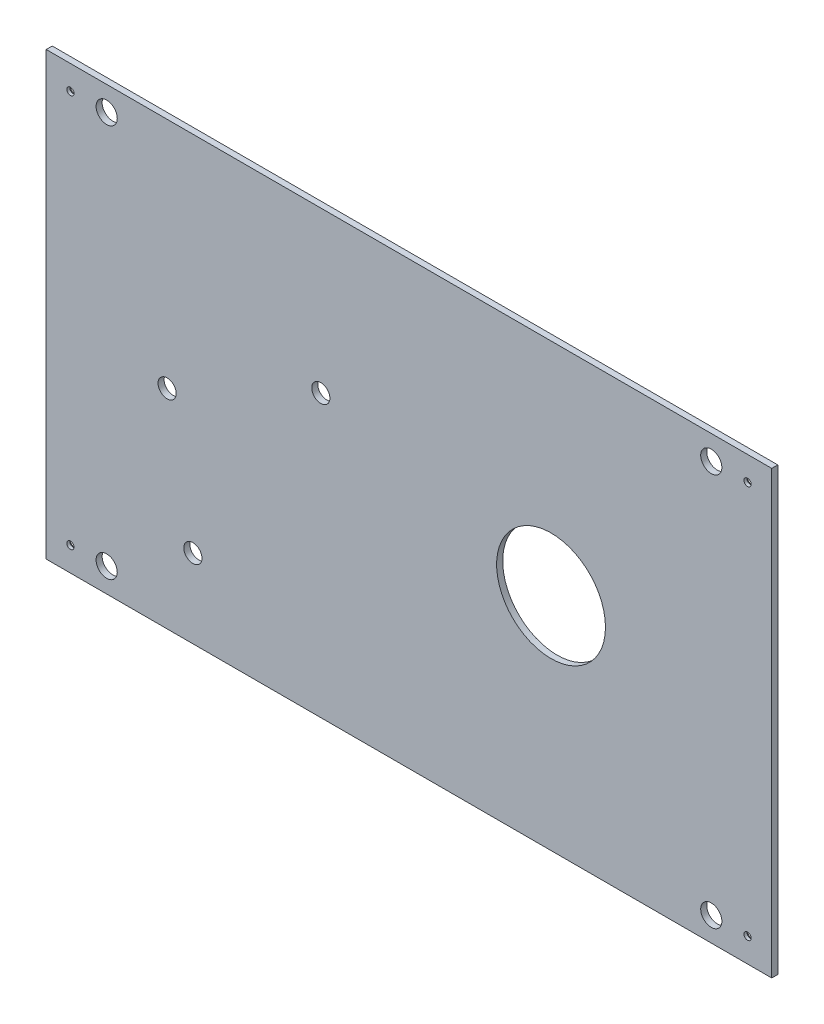
ISO-10303-21;
HEADER;
FILE_DESCRIPTION(('STEP AP214'),'2;1');
FILE_NAME('part.step','',(''),(''),'','','');
FILE_SCHEMA(('AUTOMOTIVE_DESIGN { 1 0 10303 214 1 1 1 1 }'));
ENDSEC;
DATA;
#1=APPLICATION_CONTEXT('core data for automotive mechanical design processes');
#2=APPLICATION_PROTOCOL_DEFINITION('international standard','automotive_design',2000,#1);
#3=PRODUCT_CONTEXT('',#1,'mechanical');
#4=PRODUCT('Part','Part','',(#3));
#5=PRODUCT_RELATED_PRODUCT_CATEGORY('part','',(#4));
#6=PRODUCT_DEFINITION_FORMATION('','',#4);
#7=PRODUCT_DEFINITION_CONTEXT('part definition',#1,'design');
#8=PRODUCT_DEFINITION('design','',#6,#7);
#9=PRODUCT_DEFINITION_SHAPE('','',#8);
#10=(LENGTH_UNIT() NAMED_UNIT(*) SI_UNIT(.MILLI.,.METRE.));
#11=(NAMED_UNIT(*) PLANE_ANGLE_UNIT() SI_UNIT($,.RADIAN.));
#12=(NAMED_UNIT(*) SI_UNIT($,.STERADIAN.) SOLID_ANGLE_UNIT());
#13=UNCERTAINTY_MEASURE_WITH_UNIT(LENGTH_MEASURE(1.E-05),#10,'distance_accuracy_value','');
#14=(GEOMETRIC_REPRESENTATION_CONTEXT(3) GLOBAL_UNCERTAINTY_ASSIGNED_CONTEXT((#13)) GLOBAL_UNIT_ASSIGNED_CONTEXT((#10,
#11,#12)) REPRESENTATION_CONTEXT('',''));
#15=CARTESIAN_POINT('',(0.,0.,0.));
#16=DIRECTION('',(0.,0.,1.));
#17=DIRECTION('',(1.,0.,0.));
#18=AXIS2_PLACEMENT_3D('',#15,#16,#17);
#19=CARTESIAN_POINT('',(0.,0.,2.));
#20=DIRECTION('',(0.,1.,0.));
#21=DIRECTION('',(0.,0.,1.));
#22=AXIS2_PLACEMENT_3D('',#19,#20,#21);
#23=PLANE('',#22);
#24=DIRECTION('',(1.,0.,0.));
#25=VECTOR('',#24,1.);
#26=CARTESIAN_POINT('',(0.,0.,0.));
#27=LINE('',#26,#25);
#28=CARTESIAN_POINT('',(0.,0.,0.));
#29=VERTEX_POINT('',#28);
#30=CARTESIAN_POINT('',(240.,0.,0.));
#31=VERTEX_POINT('',#30);
#32=EDGE_CURVE('E146',#29,#31,#27,.T.);
#33=ORIENTED_EDGE('',*,*,#32,.T.);
#34=DIRECTION('',(0.,0.,-1.));
#35=VECTOR('',#34,1.);
#36=CARTESIAN_POINT('',(240.,0.,2.));
#37=LINE('',#36,#35);
#38=CARTESIAN_POINT('',(240.,0.,2.));
#39=VERTEX_POINT('',#38);
#40=EDGE_CURVE('E11',#39,#31,#37,.T.);
#41=ORIENTED_EDGE('',*,*,#40,.F.);
#42=DIRECTION('',(1.,0.,0.));
#43=VECTOR('',#42,1.);
#44=CARTESIAN_POINT('',(0.,0.,2.));
#45=LINE('',#44,#43);
#46=CARTESIAN_POINT('',(0.,0.,2.));
#47=VERTEX_POINT('',#46);
#48=EDGE_CURVE('E95',#47,#39,#45,.T.);
#49=ORIENTED_EDGE('',*,*,#48,.F.);
#50=DIRECTION('',(0.,0.,-1.));
#51=VECTOR('',#50,1.);
#52=CARTESIAN_POINT('',(0.,0.,2.));
#53=LINE('',#52,#51);
#54=EDGE_CURVE('E61',#47,#29,#53,.T.);
#55=ORIENTED_EDGE('',*,*,#54,.T.);
#56=EDGE_LOOP('',(#33,#41,#49,#55));
#57=FACE_BOUND('',#56,.T.);
#58=ADVANCED_FACE('F43',(#57),#23,.F.);
#59=CARTESIAN_POINT('',(240.,0.,2.));
#60=DIRECTION('',(-1.,0.,0.));
#61=DIRECTION('',(0.,0.,1.));
#62=AXIS2_PLACEMENT_3D('',#59,#60,#61);
#63=PLANE('',#62);
#64=DIRECTION('',(0.,1.,0.));
#65=VECTOR('',#64,1.);
#66=CARTESIAN_POINT('',(240.,0.,0.));
#67=LINE('',#66,#65);
#68=CARTESIAN_POINT('',(240.,146.,0.));
#69=VERTEX_POINT('',#68);
#70=EDGE_CURVE('E101',#31,#69,#67,.T.);
#71=ORIENTED_EDGE('',*,*,#70,.T.);
#72=DIRECTION('',(0.,0.,-1.));
#73=VECTOR('',#72,1.);
#74=CARTESIAN_POINT('',(240.,146.,2.));
#75=LINE('',#74,#73);
#76=CARTESIAN_POINT('',(240.,146.,2.));
#77=VERTEX_POINT('',#76);
#78=EDGE_CURVE('E53',#77,#69,#75,.T.);
#79=ORIENTED_EDGE('',*,*,#78,.F.);
#80=DIRECTION('',(0.,1.,0.));
#81=VECTOR('',#80,1.);
#82=CARTESIAN_POINT('',(240.,0.,2.));
#83=LINE('',#82,#81);
#84=EDGE_CURVE('E86',#39,#77,#83,.T.);
#85=ORIENTED_EDGE('',*,*,#84,.F.);
#86=ORIENTED_EDGE('',*,*,#40,.T.);
#87=EDGE_LOOP('',(#71,#79,#85,#86));
#88=FACE_BOUND('',#87,.T.);
#89=ADVANCED_FACE('F100',(#88),#63,.F.);
#90=CARTESIAN_POINT('',(0.,146.,2.));
#91=DIRECTION('',(0.,1.,0.));
#92=DIRECTION('',(0.,0.,1.));
#93=AXIS2_PLACEMENT_3D('',#90,#91,#92);
#94=PLANE('',#93);
#95=DIRECTION('',(1.,0.,0.));
#96=VECTOR('',#95,1.);
#97=CARTESIAN_POINT('',(0.,146.,0.));
#98=LINE('',#97,#96);
#99=CARTESIAN_POINT('',(0.,146.,0.));
#100=VERTEX_POINT('',#99);
#101=EDGE_CURVE('E151',#100,#69,#98,.T.);
#102=ORIENTED_EDGE('',*,*,#101,.F.);
#103=DIRECTION('',(0.,0.,-1.));
#104=VECTOR('',#103,1.);
#105=CARTESIAN_POINT('',(0.,146.,2.));
#106=LINE('',#105,#104);
#107=CARTESIAN_POINT('',(0.,146.,2.));
#108=VERTEX_POINT('',#107);
#109=EDGE_CURVE('E75',#108,#100,#106,.T.);
#110=ORIENTED_EDGE('',*,*,#109,.F.);
#111=DIRECTION('',(1.,0.,0.));
#112=VECTOR('',#111,1.);
#113=CARTESIAN_POINT('',(0.,146.,2.));
#114=LINE('',#113,#112);
#115=EDGE_CURVE('E94',#108,#77,#114,.T.);
#116=ORIENTED_EDGE('',*,*,#115,.T.);
#117=ORIENTED_EDGE('',*,*,#78,.T.);
#118=EDGE_LOOP('',(#102,#110,#116,#117));
#119=FACE_BOUND('',#118,.T.);
#120=ADVANCED_FACE('F105',(#119),#94,.T.);
#121=CARTESIAN_POINT('',(220.,8.00000000000001,2.));
#122=DIRECTION('',(0.,0.,-1.));
#123=DIRECTION('',(-1.,0.,0.));
#124=AXIS2_PLACEMENT_3D('',#121,#122,#123);
#125=CYLINDRICAL_SURFACE('',#124,3.49999999999999);
#126=CARTESIAN_POINT('',(220.,8.00000000000001,2.));
#127=DIRECTION('',(0.,0.,1.));
#128=DIRECTION('',(1.,0.,0.));
#129=AXIS2_PLACEMENT_3D('',#126,#127,#128);
#130=CIRCLE('',#129,3.49999999999999);
#131=CARTESIAN_POINT('',(223.5,8.00000000000001,2.));
#132=VERTEX_POINT('',#131);
#133=EDGE_CURVE('E110',#132,#132,#130,.T.);
#134=ORIENTED_EDGE('',*,*,#133,.T.);
#135=EDGE_LOOP('',(#134));
#136=FACE_BOUND('',#135,.T.);
#137=CARTESIAN_POINT('',(220.,8.00000000000001,0.));
#138=DIRECTION('',(0.,0.,1.));
#139=DIRECTION('',(1.,0.,0.));
#140=AXIS2_PLACEMENT_3D('',#137,#138,#139);
#141=CIRCLE('',#140,3.49999999999999);
#142=CARTESIAN_POINT('',(223.5,8.00000000000001,0.));
#143=VERTEX_POINT('',#142);
#144=EDGE_CURVE('E158',#143,#143,#141,.T.);
#145=ORIENTED_EDGE('',*,*,#144,.F.);
#146=EDGE_LOOP('',(#145));
#147=FACE_BOUND('',#146,.T.);
#148=ADVANCED_FACE('F268',(#136,#147),#125,.F.);
#149=CARTESIAN_POINT('',(0.,0.,2.));
#150=DIRECTION('',(-1.,0.,0.));
#151=DIRECTION('',(0.,0.,1.));
#152=AXIS2_PLACEMENT_3D('',#149,#150,#151);
#153=PLANE('',#152);
#154=DIRECTION('',(0.,1.,0.));
#155=VECTOR('',#154,1.);
#156=CARTESIAN_POINT('',(0.,0.,0.));
#157=LINE('',#156,#155);
#158=EDGE_CURVE('E154',#29,#100,#157,.T.);
#159=ORIENTED_EDGE('',*,*,#158,.F.);
#160=ORIENTED_EDGE('',*,*,#54,.F.);
#161=DIRECTION('',(0.,1.,0.));
#162=VECTOR('',#161,1.);
#163=CARTESIAN_POINT('',(0.,0.,2.));
#164=LINE('',#163,#162);
#165=EDGE_CURVE('E107',#47,#108,#164,.T.);
#166=ORIENTED_EDGE('',*,*,#165,.T.);
#167=ORIENTED_EDGE('',*,*,#109,.T.);
#168=EDGE_LOOP('',(#159,#160,#166,#167));
#169=FACE_BOUND('',#168,.T.);
#170=ADVANCED_FACE('F233',(#169),#153,.T.);
#171=CARTESIAN_POINT('',(48.5153507489251,26.,2.));
#172=DIRECTION('',(0.,0.,-1.));
#173=DIRECTION('',(-1.,0.,0.));
#174=AXIS2_PLACEMENT_3D('',#171,#172,#173);
#175=CYLINDRICAL_SURFACE('',#174,3.);
#176=CARTESIAN_POINT('',(48.5153507489251,26.,2.));
#177=DIRECTION('',(0.,0.,1.));
#178=DIRECTION('',(1.,0.,0.));
#179=AXIS2_PLACEMENT_3D('',#176,#177,#178);
#180=CIRCLE('',#179,3.);
#181=CARTESIAN_POINT('',(51.5153507489251,26.,2.));
#182=VERTEX_POINT('',#181);
#183=EDGE_CURVE('E196',#182,#182,#180,.T.);
#184=ORIENTED_EDGE('',*,*,#183,.T.);
#185=EDGE_LOOP('',(#184));
#186=FACE_BOUND('',#185,.T.);
#187=CARTESIAN_POINT('',(48.5153507489251,26.,0.));
#188=DIRECTION('',(0.,0.,1.));
#189=DIRECTION('',(1.,0.,0.));
#190=AXIS2_PLACEMENT_3D('',#187,#188,#189);
#191=CIRCLE('',#190,3.);
#192=CARTESIAN_POINT('',(51.5153507489251,26.,0.));
#193=VERTEX_POINT('',#192);
#194=EDGE_CURVE('E142',#193,#193,#191,.T.);
#195=ORIENTED_EDGE('',*,*,#194,.F.);
#196=EDGE_LOOP('',(#195));
#197=FACE_BOUND('',#196,.T.);
#198=ADVANCED_FACE('F202',(#186,#197),#175,.F.);
#199=CARTESIAN_POINT('',(40.,68.9132998221155,2.));
#200=DIRECTION('',(0.,0.,-1.));
#201=DIRECTION('',(-1.,0.,0.));
#202=AXIS2_PLACEMENT_3D('',#199,#200,#201);
#203=CYLINDRICAL_SURFACE('',#202,3.);
#204=CARTESIAN_POINT('',(40.,68.9132998221155,2.));
#205=DIRECTION('',(0.,0.,1.));
#206=DIRECTION('',(1.,0.,0.));
#207=AXIS2_PLACEMENT_3D('',#204,#205,#206);
#208=CIRCLE('',#207,3.);
#209=CARTESIAN_POINT('',(43.,68.9132998221155,2.));
#210=VERTEX_POINT('',#209);
#211=EDGE_CURVE('E192',#210,#210,#208,.T.);
#212=ORIENTED_EDGE('',*,*,#211,.T.);
#213=EDGE_LOOP('',(#212));
#214=FACE_BOUND('',#213,.T.);
#215=CARTESIAN_POINT('',(40.,68.9132998221155,0.));
#216=DIRECTION('',(0.,0.,1.));
#217=DIRECTION('',(1.,0.,0.));
#218=AXIS2_PLACEMENT_3D('',#215,#216,#217);
#219=CIRCLE('',#218,3.);
#220=CARTESIAN_POINT('',(43.,68.9132998221155,0.));
#221=VERTEX_POINT('',#220);
#222=EDGE_CURVE('E138',#221,#221,#219,.T.);
#223=ORIENTED_EDGE('',*,*,#222,.F.);
#224=EDGE_LOOP('',(#223));
#225=FACE_BOUND('',#224,.T.);
#226=ADVANCED_FACE('F232',(#214,#225),#203,.F.);
#227=CARTESIAN_POINT('',(90.8320113170894,93.,2.));
#228=DIRECTION('',(0.,0.,-1.));
#229=DIRECTION('',(-1.,0.,0.));
#230=AXIS2_PLACEMENT_3D('',#227,#228,#229);
#231=CYLINDRICAL_SURFACE('',#230,3.00000000000001);
#232=CARTESIAN_POINT('',(90.8320113170894,93.,2.));
#233=DIRECTION('',(0.,0.,1.));
#234=DIRECTION('',(1.,0.,0.));
#235=AXIS2_PLACEMENT_3D('',#232,#233,#234);
#236=CIRCLE('',#235,3.00000000000001);
#237=CARTESIAN_POINT('',(93.8320113170894,93.,2.));
#238=VERTEX_POINT('',#237);
#239=EDGE_CURVE('E188',#238,#238,#236,.T.);
#240=ORIENTED_EDGE('',*,*,#239,.T.);
#241=EDGE_LOOP('',(#240));
#242=FACE_BOUND('',#241,.T.);
#243=CARTESIAN_POINT('',(90.8320113170894,93.,0.));
#244=DIRECTION('',(0.,0.,1.));
#245=DIRECTION('',(1.,0.,0.));
#246=AXIS2_PLACEMENT_3D('',#243,#244,#245);
#247=CIRCLE('',#246,3.00000000000001);
#248=CARTESIAN_POINT('',(93.8320113170894,93.,0.));
#249=VERTEX_POINT('',#248);
#250=EDGE_CURVE('E134',#249,#249,#247,.T.);
#251=ORIENTED_EDGE('',*,*,#250,.F.);
#252=EDGE_LOOP('',(#251));
#253=FACE_BOUND('',#252,.T.);
#254=ADVANCED_FACE('F236',(#242,#253),#231,.F.);
#255=CARTESIAN_POINT('',(167.,73.,2.));
#256=DIRECTION('',(0.,0.,-1.));
#257=DIRECTION('',(-1.,0.,0.));
#258=AXIS2_PLACEMENT_3D('',#255,#256,#257);
#259=CYLINDRICAL_SURFACE('',#258,18.);
#260=CARTESIAN_POINT('',(167.,73.,2.));
#261=DIRECTION('',(0.,0.,1.));
#262=DIRECTION('',(1.,0.,0.));
#263=AXIS2_PLACEMENT_3D('',#260,#261,#262);
#264=CIRCLE('',#263,18.);
#265=CARTESIAN_POINT('',(185.,73.,2.));
#266=VERTEX_POINT('',#265);
#267=EDGE_CURVE('E180',#266,#266,#264,.T.);
#268=ORIENTED_EDGE('',*,*,#267,.T.);
#269=EDGE_LOOP('',(#268));
#270=FACE_BOUND('',#269,.T.);
#271=CARTESIAN_POINT('',(167.,73.,0.));
#272=DIRECTION('',(0.,0.,1.));
#273=DIRECTION('',(1.,0.,0.));
#274=AXIS2_PLACEMENT_3D('',#271,#272,#273);
#275=CIRCLE('',#274,18.);
#276=CARTESIAN_POINT('',(185.,73.,0.));
#277=VERTEX_POINT('',#276);
#278=EDGE_CURVE('E130',#277,#277,#275,.T.);
#279=ORIENTED_EDGE('',*,*,#278,.F.);
#280=EDGE_LOOP('',(#279));
#281=FACE_BOUND('',#280,.T.);
#282=ADVANCED_FACE('F240',(#270,#281),#259,.F.);
#283=CARTESIAN_POINT('',(20.,138.,2.));
#284=DIRECTION('',(0.,0.,-1.));
#285=DIRECTION('',(-1.,0.,0.));
#286=AXIS2_PLACEMENT_3D('',#283,#284,#285);
#287=CYLINDRICAL_SURFACE('',#286,3.5);
#288=CARTESIAN_POINT('',(20.,138.,2.));
#289=DIRECTION('',(0.,0.,1.));
#290=DIRECTION('',(1.,0.,0.));
#291=AXIS2_PLACEMENT_3D('',#288,#289,#290);
#292=CIRCLE('',#291,3.5);
#293=CARTESIAN_POINT('',(23.5,138.,2.));
#294=VERTEX_POINT('',#293);
#295=EDGE_CURVE('E174',#294,#294,#292,.T.);
#296=ORIENTED_EDGE('',*,*,#295,.T.);
#297=EDGE_LOOP('',(#296));
#298=FACE_BOUND('',#297,.T.);
#299=CARTESIAN_POINT('',(20.,138.,0.));
#300=DIRECTION('',(0.,0.,1.));
#301=DIRECTION('',(1.,0.,0.));
#302=AXIS2_PLACEMENT_3D('',#299,#300,#301);
#303=CIRCLE('',#302,3.5);
#304=CARTESIAN_POINT('',(23.5,138.,0.));
#305=VERTEX_POINT('',#304);
#306=EDGE_CURVE('E125',#305,#305,#303,.T.);
#307=ORIENTED_EDGE('',*,*,#306,.F.);
#308=EDGE_LOOP('',(#307));
#309=FACE_BOUND('',#308,.T.);
#310=ADVANCED_FACE('F243',(#298,#309),#287,.F.);
#311=CARTESIAN_POINT('',(20.,8.00000000000001,2.));
#312=DIRECTION('',(0.,0.,-1.));
#313=DIRECTION('',(-1.,0.,0.));
#314=AXIS2_PLACEMENT_3D('',#311,#312,#313);
#315=CYLINDRICAL_SURFACE('',#314,3.5);
#316=CARTESIAN_POINT('',(20.,8.00000000000001,2.));
#317=DIRECTION('',(0.,0.,1.));
#318=DIRECTION('',(1.,0.,0.));
#319=AXIS2_PLACEMENT_3D('',#316,#317,#318);
#320=CIRCLE('',#319,3.5);
#321=CARTESIAN_POINT('',(23.5,8.00000000000001,2.));
#322=VERTEX_POINT('',#321);
#323=EDGE_CURVE('E166',#322,#322,#320,.F.);
#324=ORIENTED_EDGE('',*,*,#323,.F.);
#325=EDGE_LOOP('',(#324));
#326=FACE_BOUND('',#325,.T.);
#327=CARTESIAN_POINT('',(20.,8.00000000000001,0.));
#328=DIRECTION('',(0.,0.,1.));
#329=DIRECTION('',(1.,0.,0.));
#330=AXIS2_PLACEMENT_3D('',#327,#328,#329);
#331=CIRCLE('',#330,3.5);
#332=CARTESIAN_POINT('',(23.5,8.00000000000001,0.));
#333=VERTEX_POINT('',#332);
#334=EDGE_CURVE('E121',#333,#333,#331,.F.);
#335=ORIENTED_EDGE('',*,*,#334,.T.);
#336=EDGE_LOOP('',(#335));
#337=FACE_BOUND('',#336,.T.);
#338=ADVANCED_FACE('F45',(#326,#337),#315,.F.);
#339=CARTESIAN_POINT('',(220.,138.,2.));
#340=DIRECTION('',(0.,0.,-1.));
#341=DIRECTION('',(-1.,0.,0.));
#342=AXIS2_PLACEMENT_3D('',#339,#340,#341);
#343=CYLINDRICAL_SURFACE('',#342,3.49999999999999);
#344=CARTESIAN_POINT('',(220.,138.,2.));
#345=DIRECTION('',(0.,0.,1.));
#346=DIRECTION('',(1.,0.,0.));
#347=AXIS2_PLACEMENT_3D('',#344,#345,#346);
#348=CIRCLE('',#347,3.49999999999999);
#349=CARTESIAN_POINT('',(223.5,138.,2.));
#350=VERTEX_POINT('',#349);
#351=EDGE_CURVE('E117',#350,#350,#348,.F.);
#352=ORIENTED_EDGE('',*,*,#351,.F.);
#353=EDGE_LOOP('',(#352));
#354=FACE_BOUND('',#353,.T.);
#355=CARTESIAN_POINT('',(220.,138.,0.));
#356=DIRECTION('',(0.,0.,1.));
#357=DIRECTION('',(1.,0.,0.));
#358=AXIS2_PLACEMENT_3D('',#355,#356,#357);
#359=CIRCLE('',#358,3.49999999999999);
#360=CARTESIAN_POINT('',(223.5,138.,0.));
#361=VERTEX_POINT('',#360);
#362=EDGE_CURVE('E162',#361,#361,#359,.F.);
#363=ORIENTED_EDGE('',*,*,#362,.T.);
#364=EDGE_LOOP('',(#363));
#365=FACE_BOUND('',#364,.T.);
#366=ADVANCED_FACE('F207',(#354,#365),#343,.F.);
#367=CARTESIAN_POINT('',(0.,0.,2.));
#368=DIRECTION('',(0.,0.,1.));
#369=DIRECTION('',(1.,0.,0.));
#370=AXIS2_PLACEMENT_3D('',#367,#368,#369);
#371=PLANE('',#370);
#372=CARTESIAN_POINT('',(232.,138.,2.));
#373=DIRECTION('',(0.,0.,-1.));
#374=DIRECTION('',(-1.,0.,0.));
#375=AXIS2_PLACEMENT_3D('',#372,#373,#374);
#376=CIRCLE('',#375,1.20000000000001);
#377=CARTESIAN_POINT('',(230.8,138.,2.));
#378=VERTEX_POINT('',#377);
#379=EDGE_CURVE('E443',#378,#378,#376,.T.);
#380=ORIENTED_EDGE('',*,*,#379,.T.);
#381=EDGE_LOOP('',(#380));
#382=FACE_BOUND('',#381,.T.);
#383=CARTESIAN_POINT('',(8.,138.,2.));
#384=DIRECTION('',(0.,0.,-1.));
#385=DIRECTION('',(-1.,0.,0.));
#386=AXIS2_PLACEMENT_3D('',#383,#384,#385);
#387=CIRCLE('',#386,1.19999999999999);
#388=CARTESIAN_POINT('',(6.80000000000001,138.,2.));
#389=VERTEX_POINT('',#388);
#390=EDGE_CURVE('E456',#389,#389,#387,.T.);
#391=ORIENTED_EDGE('',*,*,#390,.T.);
#392=EDGE_LOOP('',(#391));
#393=FACE_BOUND('',#392,.T.);
#394=CARTESIAN_POINT('',(8.,8.00000000000001,2.));
#395=DIRECTION('',(0.,0.,-1.));
#396=DIRECTION('',(-1.,0.,0.));
#397=AXIS2_PLACEMENT_3D('',#394,#395,#396);
#398=CIRCLE('',#397,1.19999999999999);
#399=CARTESIAN_POINT('',(6.80000000000001,8.00000000000001,2.));
#400=VERTEX_POINT('',#399);
#401=EDGE_CURVE('E468',#400,#400,#398,.T.);
#402=ORIENTED_EDGE('',*,*,#401,.T.);
#403=EDGE_LOOP('',(#402));
#404=FACE_BOUND('',#403,.T.);
#405=CARTESIAN_POINT('',(232.,8.00000000000001,2.));
#406=DIRECTION('',(0.,0.,-1.));
#407=DIRECTION('',(-1.,0.,0.));
#408=AXIS2_PLACEMENT_3D('',#405,#406,#407);
#409=CIRCLE('',#408,1.20000000000001);
#410=CARTESIAN_POINT('',(230.8,8.00000000000001,2.));
#411=VERTEX_POINT('',#410);
#412=EDGE_CURVE('E126',#411,#411,#409,.T.);
#413=ORIENTED_EDGE('',*,*,#412,.T.);
#414=EDGE_LOOP('',(#413));
#415=FACE_BOUND('',#414,.T.);
#416=ORIENTED_EDGE('',*,*,#323,.T.);
#417=EDGE_LOOP('',(#416));
#418=FACE_BOUND('',#417,.T.);
#419=ORIENTED_EDGE('',*,*,#295,.F.);
#420=EDGE_LOOP('',(#419));
#421=FACE_BOUND('',#420,.T.);
#422=ORIENTED_EDGE('',*,*,#267,.F.);
#423=EDGE_LOOP('',(#422));
#424=FACE_BOUND('',#423,.T.);
#425=ORIENTED_EDGE('',*,*,#239,.F.);
#426=EDGE_LOOP('',(#425));
#427=FACE_BOUND('',#426,.T.);
#428=ORIENTED_EDGE('',*,*,#211,.F.);
#429=EDGE_LOOP('',(#428));
#430=FACE_BOUND('',#429,.T.);
#431=ORIENTED_EDGE('',*,*,#183,.F.);
#432=EDGE_LOOP('',(#431));
#433=FACE_BOUND('',#432,.T.);
#434=ORIENTED_EDGE('',*,*,#48,.T.);
#435=ORIENTED_EDGE('',*,*,#84,.T.);
#436=ORIENTED_EDGE('',*,*,#115,.F.);
#437=ORIENTED_EDGE('',*,*,#165,.F.);
#438=EDGE_LOOP('',(#434,#435,#436,#437));
#439=FACE_BOUND('',#438,.T.);
#440=ORIENTED_EDGE('',*,*,#133,.F.);
#441=EDGE_LOOP('',(#440));
#442=FACE_BOUND('',#441,.T.);
#443=ORIENTED_EDGE('',*,*,#351,.T.);
#444=EDGE_LOOP('',(#443));
#445=FACE_BOUND('',#444,.T.);
#446=ADVANCED_FACE('F90',(#382,#393,#404,#415,#418,#421,#424,#427,#430,#433,#439,#442,#445),
#371,.T.);
#447=CARTESIAN_POINT('',(0.,0.,0.));
#448=DIRECTION('',(0.,0.,1.));
#449=DIRECTION('',(1.,0.,0.));
#450=AXIS2_PLACEMENT_3D('',#447,#448,#449);
#451=PLANE('',#450);
#452=CARTESIAN_POINT('',(232.,138.,0.));
#453=DIRECTION('',(0.,0.,-1.));
#454=DIRECTION('',(-1.,0.,0.));
#455=AXIS2_PLACEMENT_3D('',#452,#453,#454);
#456=CIRCLE('',#455,2.20000000000001);
#457=CARTESIAN_POINT('',(229.8,138.,0.));
#458=VERTEX_POINT('',#457);
#459=EDGE_CURVE('E439',#458,#458,#456,.T.);
#460=ORIENTED_EDGE('',*,*,#459,.F.);
#461=EDGE_LOOP('',(#460));
#462=FACE_BOUND('',#461,.T.);
#463=CARTESIAN_POINT('',(8.,138.,0.));
#464=DIRECTION('',(0.,0.,-1.));
#465=DIRECTION('',(-1.,0.,0.));
#466=AXIS2_PLACEMENT_3D('',#463,#464,#465);
#467=CIRCLE('',#466,2.2);
#468=CARTESIAN_POINT('',(5.8,138.,0.));
#469=VERTEX_POINT('',#468);
#470=EDGE_CURVE('E448',#469,#469,#467,.T.);
#471=ORIENTED_EDGE('',*,*,#470,.F.);
#472=EDGE_LOOP('',(#471));
#473=FACE_BOUND('',#472,.T.);
#474=CARTESIAN_POINT('',(8.,8.00000000000001,0.));
#475=DIRECTION('',(0.,0.,-1.));
#476=DIRECTION('',(-1.,0.,0.));
#477=AXIS2_PLACEMENT_3D('',#474,#475,#476);
#478=CIRCLE('',#477,2.2);
#479=CARTESIAN_POINT('',(5.8,8.00000000000001,0.));
#480=VERTEX_POINT('',#479);
#481=EDGE_CURVE('E460',#480,#480,#478,.T.);
#482=ORIENTED_EDGE('',*,*,#481,.F.);
#483=EDGE_LOOP('',(#482));
#484=FACE_BOUND('',#483,.T.);
#485=CARTESIAN_POINT('',(232.,8.00000000000001,0.));
#486=DIRECTION('',(0.,0.,-1.));
#487=DIRECTION('',(-1.,0.,0.));
#488=AXIS2_PLACEMENT_3D('',#485,#486,#487);
#489=CIRCLE('',#488,2.20000000000001);
#490=CARTESIAN_POINT('',(229.8,8.00000000000001,0.));
#491=VERTEX_POINT('',#490);
#492=EDGE_CURVE('E472',#491,#491,#489,.T.);
#493=ORIENTED_EDGE('',*,*,#492,.F.);
#494=EDGE_LOOP('',(#493));
#495=FACE_BOUND('',#494,.T.);
#496=ORIENTED_EDGE('',*,*,#334,.F.);
#497=EDGE_LOOP('',(#496));
#498=FACE_BOUND('',#497,.T.);
#499=ORIENTED_EDGE('',*,*,#306,.T.);
#500=EDGE_LOOP('',(#499));
#501=FACE_BOUND('',#500,.T.);
#502=ORIENTED_EDGE('',*,*,#278,.T.);
#503=EDGE_LOOP('',(#502));
#504=FACE_BOUND('',#503,.T.);
#505=ORIENTED_EDGE('',*,*,#250,.T.);
#506=EDGE_LOOP('',(#505));
#507=FACE_BOUND('',#506,.T.);
#508=ORIENTED_EDGE('',*,*,#222,.T.);
#509=EDGE_LOOP('',(#508));
#510=FACE_BOUND('',#509,.T.);
#511=ORIENTED_EDGE('',*,*,#194,.T.);
#512=EDGE_LOOP('',(#511));
#513=FACE_BOUND('',#512,.T.);
#514=ORIENTED_EDGE('',*,*,#32,.F.);
#515=ORIENTED_EDGE('',*,*,#158,.T.);
#516=ORIENTED_EDGE('',*,*,#101,.T.);
#517=ORIENTED_EDGE('',*,*,#70,.F.);
#518=EDGE_LOOP('',(#514,#515,#516,#517));
#519=FACE_BOUND('',#518,.T.);
#520=ORIENTED_EDGE('',*,*,#144,.T.);
#521=EDGE_LOOP('',(#520));
#522=FACE_BOUND('',#521,.T.);
#523=ORIENTED_EDGE('',*,*,#362,.F.);
#524=EDGE_LOOP('',(#523));
#525=FACE_BOUND('',#524,.T.);
#526=ADVANCED_FACE('F206',(#462,#473,#484,#495,#498,#501,#504,#507,#510,#513,#519,#522,#525),
#451,.F.);
#527=CARTESIAN_POINT('',(232.,8.00000000000001,0.));
#528=DIRECTION('',(0.,0.,-1.));
#529=DIRECTION('',(-1.,0.,0.));
#530=AXIS2_PLACEMENT_3D('',#527,#528,#529);
#531=CYLINDRICAL_SURFACE('',#530,1.19999999999999);
#532=ORIENTED_EDGE('',*,*,#412,.F.);
#533=EDGE_LOOP('',(#532));
#534=FACE_BOUND('',#533,.T.);
#535=CARTESIAN_POINT('',(232.,8.00000000000001,1.));
#536=DIRECTION('',(0.,0.,-1.));
#537=DIRECTION('',(-1.,0.,0.));
#538=AXIS2_PLACEMENT_3D('',#535,#536,#537);
#539=CIRCLE('',#538,1.19999999999998);
#540=CARTESIAN_POINT('',(230.8,8.00000000000001,1.));
#541=VERTEX_POINT('',#540);
#542=EDGE_CURVE('E475',#541,#541,#539,.T.);
#543=ORIENTED_EDGE('',*,*,#542,.T.);
#544=EDGE_LOOP('',(#543));
#545=FACE_BOUND('',#544,.T.);
#546=ADVANCED_FACE('F214',(#534,#545),#531,.F.);
#547=CARTESIAN_POINT('',(232.,8.00000000000001,0.));
#548=DIRECTION('',(0.,0.,-1.));
#549=DIRECTION('',(-1.,0.,0.));
#550=AXIS2_PLACEMENT_3D('',#547,#548,#549);
#551=CONICAL_SURFACE('',#550,2.20000000000001,0.785398163397461);
#552=ORIENTED_EDGE('',*,*,#542,.F.);
#553=EDGE_LOOP('',(#552));
#554=FACE_BOUND('',#553,.T.);
#555=ORIENTED_EDGE('',*,*,#492,.T.);
#556=EDGE_LOOP('',(#555));
#557=FACE_BOUND('',#556,.T.);
#558=ADVANCED_FACE('F360',(#554,#557),#551,.F.);
#559=CARTESIAN_POINT('',(8.,8.00000000000001,0.));
#560=DIRECTION('',(0.,0.,-1.));
#561=DIRECTION('',(-1.,0.,0.));
#562=AXIS2_PLACEMENT_3D('',#559,#560,#561);
#563=CYLINDRICAL_SURFACE('',#562,1.19999999999999);
#564=ORIENTED_EDGE('',*,*,#401,.F.);
#565=EDGE_LOOP('',(#564));
#566=FACE_BOUND('',#565,.T.);
#567=CARTESIAN_POINT('',(8.,8.00000000000001,1.));
#568=DIRECTION('',(0.,0.,-1.));
#569=DIRECTION('',(-1.,0.,0.));
#570=AXIS2_PLACEMENT_3D('',#567,#568,#569);
#571=CIRCLE('',#570,1.19999999999999);
#572=CARTESIAN_POINT('',(6.80000000000001,8.00000000000001,1.));
#573=VERTEX_POINT('',#572);
#574=EDGE_CURVE('E464',#573,#573,#571,.T.);
#575=ORIENTED_EDGE('',*,*,#574,.T.);
#576=EDGE_LOOP('',(#575));
#577=FACE_BOUND('',#576,.T.);
#578=ADVANCED_FACE('F368',(#566,#577),#563,.F.);
#579=CARTESIAN_POINT('',(8.,8.00000000000001,0.));
#580=DIRECTION('',(0.,0.,-1.));
#581=DIRECTION('',(-1.,0.,0.));
#582=AXIS2_PLACEMENT_3D('',#579,#580,#581);
#583=CONICAL_SURFACE('',#582,2.2,0.785398163397453);
#584=ORIENTED_EDGE('',*,*,#574,.F.);
#585=EDGE_LOOP('',(#584));
#586=FACE_BOUND('',#585,.T.);
#587=ORIENTED_EDGE('',*,*,#481,.T.);
#588=EDGE_LOOP('',(#587));
#589=FACE_BOUND('',#588,.T.);
#590=ADVANCED_FACE('F377',(#586,#589),#583,.F.);
#591=CARTESIAN_POINT('',(8.,138.,0.));
#592=DIRECTION('',(0.,0.,-1.));
#593=DIRECTION('',(-1.,0.,0.));
#594=AXIS2_PLACEMENT_3D('',#591,#592,#593);
#595=CYLINDRICAL_SURFACE('',#594,1.19999999999999);
#596=ORIENTED_EDGE('',*,*,#390,.F.);
#597=EDGE_LOOP('',(#596));
#598=FACE_BOUND('',#597,.T.);
#599=CARTESIAN_POINT('',(8.,138.,1.));
#600=DIRECTION('',(0.,0.,-1.));
#601=DIRECTION('',(-1.,0.,0.));
#602=AXIS2_PLACEMENT_3D('',#599,#600,#601);
#603=CIRCLE('',#602,1.19999999999999);
#604=CARTESIAN_POINT('',(6.80000000000001,138.,1.));
#605=VERTEX_POINT('',#604);
#606=EDGE_CURVE('E452',#605,#605,#603,.T.);
#607=ORIENTED_EDGE('',*,*,#606,.T.);
#608=EDGE_LOOP('',(#607));
#609=FACE_BOUND('',#608,.T.);
#610=ADVANCED_FACE('F386',(#598,#609),#595,.F.);
#611=CARTESIAN_POINT('',(8.,138.,0.));
#612=DIRECTION('',(0.,0.,-1.));
#613=DIRECTION('',(-1.,0.,0.));
#614=AXIS2_PLACEMENT_3D('',#611,#612,#613);
#615=CONICAL_SURFACE('',#614,2.2,0.785398163397453);
#616=ORIENTED_EDGE('',*,*,#606,.F.);
#617=EDGE_LOOP('',(#616));
#618=FACE_BOUND('',#617,.T.);
#619=ORIENTED_EDGE('',*,*,#470,.T.);
#620=EDGE_LOOP('',(#619));
#621=FACE_BOUND('',#620,.T.);
#622=ADVANCED_FACE('F395',(#618,#621),#615,.F.);
#623=CARTESIAN_POINT('',(232.,138.,0.));
#624=DIRECTION('',(0.,0.,-1.));
#625=DIRECTION('',(-1.,0.,0.));
#626=AXIS2_PLACEMENT_3D('',#623,#624,#625);
#627=CYLINDRICAL_SURFACE('',#626,1.19999999999999);
#628=ORIENTED_EDGE('',*,*,#379,.F.);
#629=EDGE_LOOP('',(#628));
#630=FACE_BOUND('',#629,.T.);
#631=CARTESIAN_POINT('',(232.,138.,1.));
#632=DIRECTION('',(0.,0.,-1.));
#633=DIRECTION('',(-1.,0.,0.));
#634=AXIS2_PLACEMENT_3D('',#631,#632,#633);
#635=CIRCLE('',#634,1.19999999999998);
#636=CARTESIAN_POINT('',(230.8,138.,1.));
#637=VERTEX_POINT('',#636);
#638=EDGE_CURVE('E436',#637,#637,#635,.T.);
#639=ORIENTED_EDGE('',*,*,#638,.T.);
#640=EDGE_LOOP('',(#639));
#641=FACE_BOUND('',#640,.T.);
#642=ADVANCED_FACE('F404',(#630,#641),#627,.F.);
#643=CARTESIAN_POINT('',(232.,138.,0.));
#644=DIRECTION('',(0.,0.,-1.));
#645=DIRECTION('',(-1.,0.,0.));
#646=AXIS2_PLACEMENT_3D('',#643,#644,#645);
#647=CONICAL_SURFACE('',#646,2.20000000000001,0.785398163397461);
#648=ORIENTED_EDGE('',*,*,#638,.F.);
#649=EDGE_LOOP('',(#648));
#650=FACE_BOUND('',#649,.T.);
#651=ORIENTED_EDGE('',*,*,#459,.T.);
#652=EDGE_LOOP('',(#651));
#653=FACE_BOUND('',#652,.T.);
#654=ADVANCED_FACE('F413',(#650,#653),#647,.F.);
#655=CLOSED_SHELL('',(#58,#89,#120,#148,#170,#198,#226,#254,#282,#310,#338,#366,#446,#526,#546,
#558,#578,#590,#610,#622,#642,#654));
#656=MANIFOLD_SOLID_BREP('B2',#655);
#657=ADVANCED_BREP_SHAPE_REPRESENTATION('',(#18,#656),#14);
#658=SHAPE_DEFINITION_REPRESENTATION(#9,#657);
ENDSEC;
END-ISO-10303-21;
